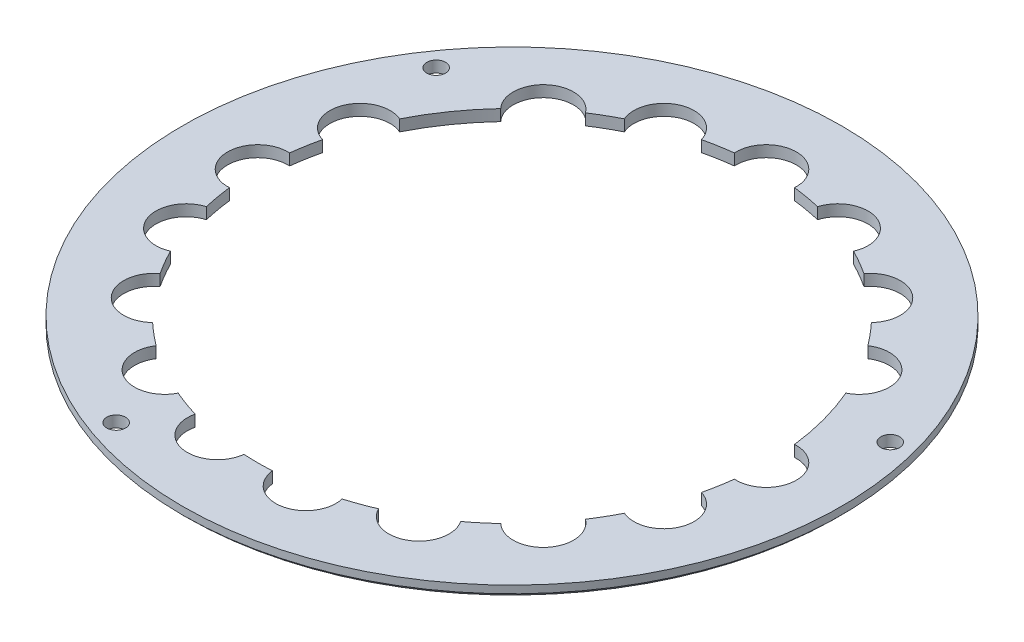
ISO-10303-21;
HEADER;
FILE_DESCRIPTION(('STEP AP214'),'2;1');
FILE_NAME('part.step','',(''),(''),'','','');
FILE_SCHEMA(('AUTOMOTIVE_DESIGN { 1 0 10303 214 1 1 1 1 }'));
ENDSEC;
DATA;
#1=APPLICATION_CONTEXT('core data for automotive mechanical design processes');
#2=APPLICATION_PROTOCOL_DEFINITION('international standard','automotive_design',2000,#1);
#3=PRODUCT_CONTEXT('',#1,'mechanical');
#4=PRODUCT('Part','Part','',(#3));
#5=PRODUCT_RELATED_PRODUCT_CATEGORY('part','',(#4));
#6=PRODUCT_DEFINITION_FORMATION('','',#4);
#7=PRODUCT_DEFINITION_CONTEXT('part definition',#1,'design');
#8=PRODUCT_DEFINITION('design','',#6,#7);
#9=PRODUCT_DEFINITION_SHAPE('','',#8);
#10=(LENGTH_UNIT() NAMED_UNIT(*) SI_UNIT(.MILLI.,.METRE.));
#11=(NAMED_UNIT(*) PLANE_ANGLE_UNIT() SI_UNIT($,.RADIAN.));
#12=(NAMED_UNIT(*) SI_UNIT($,.STERADIAN.) SOLID_ANGLE_UNIT());
#13=UNCERTAINTY_MEASURE_WITH_UNIT(LENGTH_MEASURE(1.E-05),#10,'distance_accuracy_value','');
#14=(GEOMETRIC_REPRESENTATION_CONTEXT(3) GLOBAL_UNCERTAINTY_ASSIGNED_CONTEXT((#13)) GLOBAL_UNIT_ASSIGNED_CONTEXT((#10,
#11,#12)) REPRESENTATION_CONTEXT('',''));
#15=CARTESIAN_POINT('',(0.,0.,0.));
#16=DIRECTION('',(0.,0.,1.));
#17=DIRECTION('',(1.,0.,0.));
#18=AXIS2_PLACEMENT_3D('',#15,#16,#17);
#19=CARTESIAN_POINT('',(0.,-0.00100000000000002,0.));
#20=DIRECTION('',(0.,1.,0.));
#21=DIRECTION('',(0.,0.,1.));
#22=AXIS2_PLACEMENT_3D('',#19,#20,#21);
#23=CYLINDRICAL_SURFACE('',#22,13.5);
#24=CARTESIAN_POINT('',(0.,0.,0.));
#25=DIRECTION('',(0.,1.,0.));
#26=DIRECTION('',(0.,0.,1.));
#27=AXIS2_PLACEMENT_3D('',#24,#25,#26);
#28=CIRCLE('',#27,13.5);
#29=CARTESIAN_POINT('',(-13.4051851851852,0.,-1.59718820146269));
#30=VERTEX_POINT('',#29);
#31=CARTESIAN_POINT('',(-13.1430241363694,0.,-3.08397739142346));
#32=VERTEX_POINT('',#31);
#33=EDGE_CURVE('E282',#30,#32,#28,.F.);
#34=ORIENTED_EDGE('',*,*,#33,.T.);
#35=DIRECTION('',(0.,1.,0.));
#36=VECTOR('',#35,1.);
#37=CARTESIAN_POINT('',(-13.1430241363694,0.3,-3.08397739142346));
#38=LINE('',#37,#36);
#39=CARTESIAN_POINT('',(-13.1430241363694,0.6,-3.08397739142346));
#40=VERTEX_POINT('',#39);
#41=EDGE_CURVE('E62',#40,#32,#38,.F.);
#42=ORIENTED_EDGE('',*,*,#41,.F.);
#43=CARTESIAN_POINT('',(0.,0.6,0.));
#44=DIRECTION('',(0.,1.,0.));
#45=DIRECTION('',(0.,0.,1.));
#46=AXIS2_PLACEMENT_3D('',#43,#44,#45);
#47=CIRCLE('',#46,13.5);
#48=CARTESIAN_POINT('',(-13.4051851851852,0.6,-1.5971882014627));
#49=VERTEX_POINT('',#48);
#50=EDGE_CURVE('E279',#40,#49,#47,.T.);
#51=ORIENTED_EDGE('',*,*,#50,.T.);
#52=DIRECTION('',(0.,1.,0.));
#53=VECTOR('',#52,1.);
#54=CARTESIAN_POINT('',(-13.4051851851852,0.3,-1.5971882014627));
#55=LINE('',#54,#53);
#56=EDGE_CURVE('E567',#30,#49,#55,.T.);
#57=ORIENTED_EDGE('',*,*,#56,.F.);
#58=EDGE_LOOP('',(#34,#42,#51,#57));
#59=FACE_BOUND('',#58,.T.);
#60=ADVANCED_FACE('F47',(#59),#23,.F.);
#61=CARTESIAN_POINT('',(-13.1430241363695,0.,3.08397739142328));
#62=VERTEX_POINT('',#61);
#63=CARTESIAN_POINT('',(-13.4051851851852,0.,1.59718820146269));
#64=VERTEX_POINT('',#63);
#65=EDGE_CURVE('E554',#62,#64,#28,.F.);
#66=ORIENTED_EDGE('',*,*,#65,.T.);
#67=DIRECTION('',(0.,1.,0.));
#68=VECTOR('',#67,1.);
#69=CARTESIAN_POINT('',(-13.4051851851852,0.3,1.5971882014627));
#70=LINE('',#69,#68);
#71=CARTESIAN_POINT('',(-13.4051851851852,0.6,1.5971882014627));
#72=VERTEX_POINT('',#71);
#73=EDGE_CURVE('E70',#72,#64,#70,.F.);
#74=ORIENTED_EDGE('',*,*,#73,.F.);
#75=CARTESIAN_POINT('',(-13.1430241363695,0.6,3.08397739142328));
#76=VERTEX_POINT('',#75);
#77=EDGE_CURVE('E291',#72,#76,#47,.T.);
#78=ORIENTED_EDGE('',*,*,#77,.T.);
#79=DIRECTION('',(0.,1.,0.));
#80=VECTOR('',#79,1.);
#81=CARTESIAN_POINT('',(-13.1430241363695,0.3,3.08397739142328));
#82=LINE('',#81,#80);
#83=EDGE_CURVE('E561',#62,#76,#82,.T.);
#84=ORIENTED_EDGE('',*,*,#83,.F.);
#85=EDGE_LOOP('',(#66,#74,#78,#84));
#86=FACE_BOUND('',#85,.T.);
#87=ADVANCED_FACE('F559',(#86),#23,.F.);
#88=CARTESIAN_POINT('',(-11.2956204063297,0.,7.39316979624485));
#89=VERTEX_POINT('',#88);
#90=CARTESIAN_POINT('',(-12.0504830612048,0.,6.0857093252649));
#91=VERTEX_POINT('',#90);
#92=EDGE_CURVE('E552',#89,#91,#28,.F.);
#93=ORIENTED_EDGE('',*,*,#92,.T.);
#94=DIRECTION('',(0.,1.,0.));
#95=VECTOR('',#94,1.);
#96=CARTESIAN_POINT('',(-12.0504830612048,0.3,6.08570932526491));
#97=LINE('',#96,#95);
#98=CARTESIAN_POINT('',(-12.0504830612048,0.6,6.08570932526491));
#99=VERTEX_POINT('',#98);
#100=EDGE_CURVE('E447',#99,#91,#97,.F.);
#101=ORIENTED_EDGE('',*,*,#100,.F.);
#102=CARTESIAN_POINT('',(-11.2956204063297,0.6,7.39316979624484));
#103=VERTEX_POINT('',#102);
#104=EDGE_CURVE('E296',#99,#103,#47,.T.);
#105=ORIENTED_EDGE('',*,*,#104,.T.);
#106=DIRECTION('',(0.,1.,0.));
#107=VECTOR('',#106,1.);
#108=CARTESIAN_POINT('',(-11.2956204063297,0.3,7.39316979624484));
#109=LINE('',#108,#107);
#110=EDGE_CURVE('E445',#89,#103,#109,.T.);
#111=ORIENTED_EDGE('',*,*,#110,.F.);
#112=EDGE_LOOP('',(#93,#101,#105,#111));
#113=FACE_BOUND('',#112,.T.);
#114=ADVANCED_FACE('F444',(#113),#23,.F.);
#115=CARTESIAN_POINT('',(-8.08579814968411,0.,10.8106368120738));
#116=VERTEX_POINT('',#115);
#117=CARTESIAN_POINT('',(-9.24231483385427,0.,9.84020408893623));
#118=VERTEX_POINT('',#117);
#119=EDGE_CURVE('E549',#116,#118,#28,.F.);
#120=ORIENTED_EDGE('',*,*,#119,.T.);
#121=DIRECTION('',(0.,1.,0.));
#122=VECTOR('',#121,1.);
#123=CARTESIAN_POINT('',(-9.24231483385426,0.3,9.84020408893624));
#124=LINE('',#123,#122);
#125=CARTESIAN_POINT('',(-9.24231483385426,0.6,9.84020408893624));
#126=VERTEX_POINT('',#125);
#127=EDGE_CURVE('E455',#126,#118,#124,.F.);
#128=ORIENTED_EDGE('',*,*,#127,.F.);
#129=CARTESIAN_POINT('',(-8.08579814968412,0.6,10.8106368120738));
#130=VERTEX_POINT('',#129);
#131=EDGE_CURVE('E427',#126,#130,#47,.T.);
#132=ORIENTED_EDGE('',*,*,#131,.T.);
#133=DIRECTION('',(0.,1.,0.));
#134=VECTOR('',#133,1.);
#135=CARTESIAN_POINT('',(-8.08579814968411,0.3,10.8106368120738));
#136=LINE('',#135,#134);
#137=EDGE_CURVE('E464',#116,#130,#136,.T.);
#138=ORIENTED_EDGE('',*,*,#137,.F.);
#139=EDGE_LOOP('',(#120,#128,#132,#138));
#140=FACE_BOUND('',#139,.T.);
#141=ADVANCED_FACE('F578',(#140),#23,.F.);
#142=CARTESIAN_POINT('',(-3.90070930251527,0.,12.9241814803596));
#143=VERTEX_POINT('',#142);
#144=CARTESIAN_POINT('',(-5.31938703550118,0.,12.4078250135365));
#145=VERTEX_POINT('',#144);
#146=EDGE_CURVE('E546',#143,#145,#28,.F.);
#147=ORIENTED_EDGE('',*,*,#146,.T.);
#148=DIRECTION('',(0.,1.,0.));
#149=VECTOR('',#148,1.);
#150=CARTESIAN_POINT('',(-5.31938703550118,0.3,12.4078250135365));
#151=LINE('',#150,#149);
#152=CARTESIAN_POINT('',(-5.31938703550118,0.6,12.4078250135365));
#153=VERTEX_POINT('',#152);
#154=EDGE_CURVE('E459',#153,#145,#151,.F.);
#155=ORIENTED_EDGE('',*,*,#154,.F.);
#156=CARTESIAN_POINT('',(-3.90070930251527,0.6,12.9241814803596));
#157=VERTEX_POINT('',#156);
#158=EDGE_CURVE('E421',#153,#157,#47,.T.);
#159=ORIENTED_EDGE('',*,*,#158,.T.);
#160=DIRECTION('',(0.,1.,0.));
#161=VECTOR('',#160,1.);
#162=CARTESIAN_POINT('',(-3.90070930251527,0.3,12.9241814803596));
#163=LINE('',#162,#161);
#164=EDGE_CURVE('E472',#143,#157,#163,.T.);
#165=ORIENTED_EDGE('',*,*,#164,.F.);
#166=EDGE_LOOP('',(#147,#155,#159,#165));
#167=FACE_BOUND('',#166,.T.);
#168=ADVANCED_FACE('F580',(#167),#23,.F.);
#169=CARTESIAN_POINT('',(0.754862654875016,0.,13.4788791215099));
#170=VERTEX_POINT('',#169);
#171=CARTESIAN_POINT('',(-0.754862654875107,0.,13.4788791215099));
#172=VERTEX_POINT('',#171);
#173=EDGE_CURVE('E543',#170,#172,#28,.F.);
#174=ORIENTED_EDGE('',*,*,#173,.T.);
#175=DIRECTION('',(0.,1.,0.));
#176=VECTOR('',#175,1.);
#177=CARTESIAN_POINT('',(-0.754862654875103,0.3,13.4788791215099));
#178=LINE('',#177,#176);
#179=CARTESIAN_POINT('',(-0.754862654875103,0.6,13.4788791215099));
#180=VERTEX_POINT('',#179);
#181=EDGE_CURVE('E470',#180,#172,#178,.F.);
#182=ORIENTED_EDGE('',*,*,#181,.F.);
#183=CARTESIAN_POINT('',(0.754862654875012,0.6,13.4788791215099));
#184=VERTEX_POINT('',#183);
#185=EDGE_CURVE('E415',#180,#184,#47,.T.);
#186=ORIENTED_EDGE('',*,*,#185,.T.);
#187=DIRECTION('',(0.,1.,0.));
#188=VECTOR('',#187,1.);
#189=CARTESIAN_POINT('',(0.754862654875012,0.3,13.4788791215099));
#190=LINE('',#189,#188);
#191=EDGE_CURVE('E480',#170,#184,#190,.T.);
#192=ORIENTED_EDGE('',*,*,#191,.F.);
#193=EDGE_LOOP('',(#174,#182,#186,#192));
#194=FACE_BOUND('',#193,.T.);
#195=ADVANCED_FACE('F586',(#194),#23,.F.);
#196=CARTESIAN_POINT('',(5.3193870355011,0.,12.4078250135365));
#197=VERTEX_POINT('',#196);
#198=CARTESIAN_POINT('',(3.90070930251518,0.,12.9241814803597));
#199=VERTEX_POINT('',#198);
#200=EDGE_CURVE('E540',#197,#199,#28,.F.);
#201=ORIENTED_EDGE('',*,*,#200,.T.);
#202=DIRECTION('',(0.,1.,0.));
#203=VECTOR('',#202,1.);
#204=CARTESIAN_POINT('',(3.90070930251519,0.3,12.9241814803597));
#205=LINE('',#204,#203);
#206=CARTESIAN_POINT('',(3.90070930251519,0.6,12.9241814803597));
#207=VERTEX_POINT('',#206);
#208=EDGE_CURVE('E478',#207,#199,#205,.F.);
#209=ORIENTED_EDGE('',*,*,#208,.F.);
#210=CARTESIAN_POINT('',(5.31938703550109,0.6,12.4078250135365));
#211=VERTEX_POINT('',#210);
#212=EDGE_CURVE('E409',#207,#211,#47,.T.);
#213=ORIENTED_EDGE('',*,*,#212,.T.);
#214=DIRECTION('',(0.,1.,0.));
#215=VECTOR('',#214,1.);
#216=CARTESIAN_POINT('',(5.31938703550109,0.3,12.4078250135365));
#217=LINE('',#216,#215);
#218=EDGE_CURVE('E488',#197,#211,#217,.T.);
#219=ORIENTED_EDGE('',*,*,#218,.F.);
#220=EDGE_LOOP('',(#201,#209,#213,#219));
#221=FACE_BOUND('',#220,.T.);
#222=ADVANCED_FACE('F716',(#221),#23,.F.);
#223=CARTESIAN_POINT('',(9.2423148338542,0.,9.8402040889363));
#224=VERTEX_POINT('',#223);
#225=CARTESIAN_POINT('',(8.08579814968404,0.,10.8106368120738));
#226=VERTEX_POINT('',#225);
#227=EDGE_CURVE('E537',#224,#226,#28,.F.);
#228=ORIENTED_EDGE('',*,*,#227,.T.);
#229=DIRECTION('',(0.,1.,0.));
#230=VECTOR('',#229,1.);
#231=CARTESIAN_POINT('',(8.08579814968404,0.3,10.8106368120738));
#232=LINE('',#231,#230);
#233=CARTESIAN_POINT('',(8.08579814968404,0.6,10.8106368120738));
#234=VERTEX_POINT('',#233);
#235=EDGE_CURVE('E486',#234,#226,#232,.F.);
#236=ORIENTED_EDGE('',*,*,#235,.F.);
#237=CARTESIAN_POINT('',(9.2423148338542,0.6,9.8402040889363));
#238=VERTEX_POINT('',#237);
#239=EDGE_CURVE('E403',#234,#238,#47,.T.);
#240=ORIENTED_EDGE('',*,*,#239,.T.);
#241=DIRECTION('',(0.,1.,0.));
#242=VECTOR('',#241,1.);
#243=CARTESIAN_POINT('',(9.2423148338542,0.3,9.8402040889363));
#244=LINE('',#243,#242);
#245=EDGE_CURVE('E496',#224,#238,#244,.T.);
#246=ORIENTED_EDGE('',*,*,#245,.F.);
#247=EDGE_LOOP('',(#228,#236,#240,#246));
#248=FACE_BOUND('',#247,.T.);
#249=ADVANCED_FACE('F712',(#248),#23,.F.);
#250=CARTESIAN_POINT('',(12.0504830612048,0.,6.08570932526499));
#251=VERTEX_POINT('',#250);
#252=CARTESIAN_POINT('',(11.2956204063297,0.,7.39316979624492));
#253=VERTEX_POINT('',#252);
#254=EDGE_CURVE('E532',#251,#253,#28,.F.);
#255=ORIENTED_EDGE('',*,*,#254,.T.);
#256=DIRECTION('',(0.,1.,0.));
#257=VECTOR('',#256,1.);
#258=CARTESIAN_POINT('',(11.2956204063297,0.3,7.39316979624492));
#259=LINE('',#258,#257);
#260=CARTESIAN_POINT('',(11.2956204063297,0.6,7.39316979624492));
#261=VERTEX_POINT('',#260);
#262=EDGE_CURVE('E494',#261,#253,#259,.F.);
#263=ORIENTED_EDGE('',*,*,#262,.F.);
#264=CARTESIAN_POINT('',(12.0504830612048,0.6,6.08570932526499));
#265=VERTEX_POINT('',#264);
#266=EDGE_CURVE('E397',#261,#265,#47,.T.);
#267=ORIENTED_EDGE('',*,*,#266,.T.);
#268=DIRECTION('',(0.,1.,0.));
#269=VECTOR('',#268,1.);
#270=CARTESIAN_POINT('',(12.0504830612048,0.3,6.08570932526499));
#271=LINE('',#270,#269);
#272=EDGE_CURVE('E504',#251,#265,#271,.T.);
#273=ORIENTED_EDGE('',*,*,#272,.F.);
#274=EDGE_LOOP('',(#255,#263,#267,#273));
#275=FACE_BOUND('',#274,.T.);
#276=ADVANCED_FACE('F708',(#275),#23,.F.);
#277=CARTESIAN_POINT('',(13.4051851851852,0.,1.59718820146269));
#278=VERTEX_POINT('',#277);
#279=CARTESIAN_POINT('',(13.1430241363694,0.,3.08397739142337));
#280=VERTEX_POINT('',#279);
#281=EDGE_CURVE('E528',#278,#280,#28,.F.);
#282=ORIENTED_EDGE('',*,*,#281,.T.);
#283=DIRECTION('',(0.,1.,0.));
#284=VECTOR('',#283,1.);
#285=CARTESIAN_POINT('',(13.1430241363694,0.3,3.08397739142337));
#286=LINE('',#285,#284);
#287=CARTESIAN_POINT('',(13.1430241363694,0.6,3.08397739142337));
#288=VERTEX_POINT('',#287);
#289=EDGE_CURVE('E502',#288,#280,#286,.F.);
#290=ORIENTED_EDGE('',*,*,#289,.F.);
#291=CARTESIAN_POINT('',(13.4051851851852,0.6,1.5971882014627));
#292=VERTEX_POINT('',#291);
#293=EDGE_CURVE('E393',#288,#292,#47,.T.);
#294=ORIENTED_EDGE('',*,*,#293,.T.);
#295=DIRECTION('',(0.,1.,0.));
#296=VECTOR('',#295,1.);
#297=CARTESIAN_POINT('',(13.4051851851852,0.3,1.5971882014627));
#298=LINE('',#297,#296);
#299=EDGE_CURVE('E512',#278,#292,#298,.T.);
#300=ORIENTED_EDGE('',*,*,#299,.F.);
#301=EDGE_LOOP('',(#282,#290,#294,#300));
#302=FACE_BOUND('',#301,.T.);
#303=ADVANCED_FACE('F627',(#302),#23,.F.);
#304=CARTESIAN_POINT('',(12.4078250135365,0.,-5.31938703550114));
#305=VERTEX_POINT('',#304);
#306=CARTESIAN_POINT('',(13.4051851851852,0.,-1.59718820146269));
#307=VERTEX_POINT('',#306);
#308=EDGE_CURVE('E307',#305,#307,#28,.F.);
#309=ORIENTED_EDGE('',*,*,#308,.T.);
#310=DIRECTION('',(0.,1.,0.));
#311=VECTOR('',#310,1.);
#312=CARTESIAN_POINT('',(13.4051851851852,0.3,-1.5971882014627));
#313=LINE('',#312,#311);
#314=CARTESIAN_POINT('',(13.4051851851852,0.6,-1.5971882014627));
#315=VERTEX_POINT('',#314);
#316=EDGE_CURVE('E510',#315,#307,#313,.F.);
#317=ORIENTED_EDGE('',*,*,#316,.F.);
#318=CARTESIAN_POINT('',(12.4078250135365,0.6,-5.31938703550114));
#319=VERTEX_POINT('',#318);
#320=EDGE_CURVE('E295',#315,#319,#47,.T.);
#321=ORIENTED_EDGE('',*,*,#320,.T.);
#322=DIRECTION('',(0.,1.,0.));
#323=VECTOR('',#322,1.);
#324=CARTESIAN_POINT('',(12.4078250135365,0.3,-5.31938703550114));
#325=LINE('',#324,#323);
#326=EDGE_CURVE('E385',#305,#319,#325,.T.);
#327=ORIENTED_EDGE('',*,*,#326,.F.);
#328=EDGE_LOOP('',(#309,#317,#321,#327));
#329=FACE_BOUND('',#328,.T.);
#330=ADVANCED_FACE('F623',(#329),#23,.F.);
#331=CARTESIAN_POINT('',(-9.84020408893633,0.6,-9.24231483385416));
#332=VERTEX_POINT('',#331);
#333=CARTESIAN_POINT('',(-12.0504830612047,0.6,-6.08570932526507));
#334=VERTEX_POINT('',#333);
#335=EDGE_CURVE('E290',#332,#334,#47,.T.);
#336=ORIENTED_EDGE('',*,*,#335,.T.);
#337=DIRECTION('',(0.,1.,0.));
#338=VECTOR('',#337,1.);
#339=CARTESIAN_POINT('',(-12.0504830612047,0.3,-6.08570932526507));
#340=LINE('',#339,#338);
#341=CARTESIAN_POINT('',(-12.0504830612047,0.,-6.08570932526507));
#342=VERTEX_POINT('',#341);
#343=EDGE_CURVE('E269',#342,#334,#340,.T.);
#344=ORIENTED_EDGE('',*,*,#343,.F.);
#345=CARTESIAN_POINT('',(-9.84020408893633,0.,-9.24231483385416));
#346=VERTEX_POINT('',#345);
#347=EDGE_CURVE('E523',#342,#346,#28,.F.);
#348=ORIENTED_EDGE('',*,*,#347,.T.);
#349=DIRECTION('',(0.,1.,0.));
#350=VECTOR('',#349,1.);
#351=CARTESIAN_POINT('',(-9.84020408893633,0.3,-9.24231483385416));
#352=LINE('',#351,#350);
#353=EDGE_CURVE('E345',#332,#346,#352,.F.);
#354=ORIENTED_EDGE('',*,*,#353,.F.);
#355=EDGE_LOOP('',(#336,#344,#348,#354));
#356=FACE_BOUND('',#355,.T.);
#357=ADVANCED_FACE('F619',(#356),#23,.F.);
#358=CARTESIAN_POINT('',(-6.08570932526503,0.6,-12.0504830612047));
#359=VERTEX_POINT('',#358);
#360=CARTESIAN_POINT('',(-7.39316979624496,0.6,-11.2956204063297));
#361=VERTEX_POINT('',#360);
#362=EDGE_CURVE('E294',#359,#361,#47,.T.);
#363=ORIENTED_EDGE('',*,*,#362,.T.);
#364=DIRECTION('',(0.,1.,0.));
#365=VECTOR('',#364,1.);
#366=CARTESIAN_POINT('',(-7.39316979624496,0.3,-11.2956204063297));
#367=LINE('',#366,#365);
#368=CARTESIAN_POINT('',(-7.39316979624496,0.,-11.2956204063297));
#369=VERTEX_POINT('',#368);
#370=EDGE_CURVE('E331',#369,#361,#367,.T.);
#371=ORIENTED_EDGE('',*,*,#370,.F.);
#372=CARTESIAN_POINT('',(-6.08570932526503,0.,-12.0504830612047));
#373=VERTEX_POINT('',#372);
#374=EDGE_CURVE('E525',#369,#373,#28,.F.);
#375=ORIENTED_EDGE('',*,*,#374,.T.);
#376=DIRECTION('',(0.,1.,0.));
#377=VECTOR('',#376,1.);
#378=CARTESIAN_POINT('',(-6.08570932526503,0.3,-12.0504830612047));
#379=LINE('',#378,#377);
#380=EDGE_CURVE('E334',#359,#373,#379,.F.);
#381=ORIENTED_EDGE('',*,*,#380,.F.);
#382=EDGE_LOOP('',(#363,#371,#375,#381));
#383=FACE_BOUND('',#382,.T.);
#384=ADVANCED_FACE('F330',(#383),#23,.F.);
#385=CARTESIAN_POINT('',(-1.59718820146275,0.6,-13.4051851851852));
#386=VERTEX_POINT('',#385);
#387=CARTESIAN_POINT('',(-3.08397739142342,0.6,-13.1430241363694));
#388=VERTEX_POINT('',#387);
#389=EDGE_CURVE('E315',#386,#388,#47,.T.);
#390=ORIENTED_EDGE('',*,*,#389,.T.);
#391=DIRECTION('',(0.,1.,0.));
#392=VECTOR('',#391,1.);
#393=CARTESIAN_POINT('',(-3.08397739142342,0.3,-13.1430241363694));
#394=LINE('',#393,#392);
#395=CARTESIAN_POINT('',(-3.08397739142342,0.,-13.1430241363694));
#396=VERTEX_POINT('',#395);
#397=EDGE_CURVE('E350',#396,#388,#394,.T.);
#398=ORIENTED_EDGE('',*,*,#397,.F.);
#399=CARTESIAN_POINT('',(-1.59718820146274,0.,-13.4051851851852));
#400=VERTEX_POINT('',#399);
#401=EDGE_CURVE('E527',#396,#400,#28,.F.);
#402=ORIENTED_EDGE('',*,*,#401,.T.);
#403=DIRECTION('',(0.,1.,0.));
#404=VECTOR('',#403,1.);
#405=CARTESIAN_POINT('',(-1.59718820146275,0.3,-13.4051851851852));
#406=LINE('',#405,#404);
#407=EDGE_CURVE('E355',#386,#400,#406,.F.);
#408=ORIENTED_EDGE('',*,*,#407,.F.);
#409=EDGE_LOOP('',(#390,#398,#402,#408));
#410=FACE_BOUND('',#409,.T.);
#411=ADVANCED_FACE('F612',(#410),#23,.F.);
#412=CARTESIAN_POINT('',(3.08397739142332,0.6,-13.1430241363694));
#413=VERTEX_POINT('',#412);
#414=CARTESIAN_POINT('',(1.59718820146264,0.6,-13.4051851851852));
#415=VERTEX_POINT('',#414);
#416=EDGE_CURVE('E309',#413,#415,#47,.T.);
#417=ORIENTED_EDGE('',*,*,#416,.T.);
#418=DIRECTION('',(0.,1.,0.));
#419=VECTOR('',#418,1.);
#420=CARTESIAN_POINT('',(1.59718820146264,0.3,-13.4051851851852));
#421=LINE('',#420,#419);
#422=CARTESIAN_POINT('',(1.59718820146264,0.,-13.4051851851852));
#423=VERTEX_POINT('',#422);
#424=EDGE_CURVE('E358',#423,#415,#421,.T.);
#425=ORIENTED_EDGE('',*,*,#424,.F.);
#426=CARTESIAN_POINT('',(3.08397739142332,0.,-13.1430241363694));
#427=VERTEX_POINT('',#426);
#428=EDGE_CURVE('E529',#423,#427,#28,.F.);
#429=ORIENTED_EDGE('',*,*,#428,.T.);
#430=DIRECTION('',(0.,1.,0.));
#431=VECTOR('',#430,1.);
#432=CARTESIAN_POINT('',(3.08397739142332,0.3,-13.1430241363694));
#433=LINE('',#432,#431);
#434=EDGE_CURVE('E364',#413,#427,#433,.F.);
#435=ORIENTED_EDGE('',*,*,#434,.F.);
#436=EDGE_LOOP('',(#417,#425,#429,#435));
#437=FACE_BOUND('',#436,.T.);
#438=ADVANCED_FACE('F606',(#437),#23,.F.);
#439=CARTESIAN_POINT('',(7.39316979624488,0.6,-11.2956204063297));
#440=VERTEX_POINT('',#439);
#441=CARTESIAN_POINT('',(6.08570932526494,0.6,-12.0504830612048));
#442=VERTEX_POINT('',#441);
#443=EDGE_CURVE('E301',#440,#442,#47,.T.);
#444=ORIENTED_EDGE('',*,*,#443,.T.);
#445=DIRECTION('',(0.,1.,0.));
#446=VECTOR('',#445,1.);
#447=CARTESIAN_POINT('',(6.08570932526494,0.3,-12.0504830612048));
#448=LINE('',#447,#446);
#449=CARTESIAN_POINT('',(6.08570932526494,0.,-12.0504830612048));
#450=VERTEX_POINT('',#449);
#451=EDGE_CURVE('E367',#450,#442,#448,.T.);
#452=ORIENTED_EDGE('',*,*,#451,.F.);
#453=CARTESIAN_POINT('',(7.39316979624487,0.,-11.2956204063297));
#454=VERTEX_POINT('',#453);
#455=EDGE_CURVE('E306',#450,#454,#28,.F.);
#456=ORIENTED_EDGE('',*,*,#455,.T.);
#457=DIRECTION('',(0.,1.,0.));
#458=VECTOR('',#457,1.);
#459=CARTESIAN_POINT('',(7.39316979624488,0.3,-11.2956204063297));
#460=LINE('',#459,#458);
#461=EDGE_CURVE('E373',#440,#454,#460,.F.);
#462=ORIENTED_EDGE('',*,*,#461,.F.);
#463=EDGE_LOOP('',(#444,#452,#456,#462));
#464=FACE_BOUND('',#463,.T.);
#465=ADVANCED_FACE('F596',(#464),#23,.F.);
#466=CARTESIAN_POINT('',(0.,0.6,0.));
#467=DIRECTION('',(0.,-1.,0.));
#468=DIRECTION('',(0.,0.,-1.));
#469=AXIS2_PLACEMENT_3D('',#466,#467,#468);
#470=CYLINDRICAL_SURFACE('',#469,17.5);
#471=CARTESIAN_POINT('',(0.,0.200000000000006,0.));
#472=DIRECTION('',(0.,1.,0.));
#473=DIRECTION('',(0.,0.,1.));
#474=AXIS2_PLACEMENT_3D('',#471,#472,#473);
#475=CIRCLE('',#474,17.5);
#476=CARTESIAN_POINT('',(0.,0.200000000000006,17.5));
#477=VERTEX_POINT('',#476);
#478=EDGE_CURVE('E55',#477,#477,#475,.T.);
#479=ORIENTED_EDGE('',*,*,#478,.T.);
#480=EDGE_LOOP('',(#479));
#481=FACE_BOUND('',#480,.T.);
#482=CARTESIAN_POINT('',(0.,0.6,0.));
#483=DIRECTION('',(0.,1.,0.));
#484=DIRECTION('',(0.,0.,1.));
#485=AXIS2_PLACEMENT_3D('',#482,#483,#484);
#486=CIRCLE('',#485,17.5);
#487=CARTESIAN_POINT('',(0.,0.6,17.5));
#488=VERTEX_POINT('',#487);
#489=EDGE_CURVE('E535',#488,#488,#486,.T.);
#490=ORIENTED_EDGE('',*,*,#489,.F.);
#491=EDGE_LOOP('',(#490));
#492=FACE_BOUND('',#491,.T.);
#493=ADVANCED_FACE('F605',(#481,#492),#470,.T.);
#494=CARTESIAN_POINT('',(0.,0.6,0.));
#495=DIRECTION('',(0.,1.,0.));
#496=DIRECTION('',(0.,0.,1.));
#497=AXIS2_PLACEMENT_3D('',#494,#495,#496);
#498=PLANE('',#497);
#499=CARTESIAN_POINT('',(15.8411835511407,0.6,-4.24463233968135));
#500=DIRECTION('',(0.,1.,0.));
#501=DIRECTION('',(0.,0.,1.));
#502=AXIS2_PLACEMENT_3D('',#499,#500,#501);
#503=CIRCLE('',#502,0.5);
#504=CARTESIAN_POINT('',(15.8411835511407,0.6,-3.74463233968135));
#505=VERTEX_POINT('',#504);
#506=EDGE_CURVE('E966',#505,#505,#503,.T.);
#507=ORIENTED_EDGE('',*,*,#506,.F.);
#508=EDGE_LOOP('',(#507));
#509=FACE_BOUND('',#508,.T.);
#510=CARTESIAN_POINT('',(-13.4340935263395,0.6,-9.40665355615707));
#511=DIRECTION('',(0.,1.,0.));
#512=DIRECTION('',(0.,0.,1.));
#513=AXIS2_PLACEMENT_3D('',#510,#511,#512);
#514=CIRCLE('',#513,0.5);
#515=CARTESIAN_POINT('',(-13.4340935263395,0.6,-8.90665355615707));
#516=VERTEX_POINT('',#515);
#517=EDGE_CURVE('E962',#516,#516,#514,.T.);
#518=ORIENTED_EDGE('',*,*,#517,.F.);
#519=EDGE_LOOP('',(#518));
#520=FACE_BOUND('',#519,.T.);
#521=CARTESIAN_POINT('',(-5.60913035054103,0.6,15.4109589808889));
#522=DIRECTION('',(0.,1.,0.));
#523=DIRECTION('',(0.,0.,1.));
#524=AXIS2_PLACEMENT_3D('',#521,#522,#523);
#525=CIRCLE('',#524,0.5);
#526=CARTESIAN_POINT('',(-5.60913035054103,0.6,15.9109589808889));
#527=VERTEX_POINT('',#526);
#528=EDGE_CURVE('E957',#527,#527,#525,.T.);
#529=ORIENTED_EDGE('',*,*,#528,.F.);
#530=EDGE_LOOP('',(#529));
#531=FACE_BOUND('',#530,.T.);
#532=CARTESIAN_POINT('',(-12.6858503806097,0.6,-4.61727193489662));
#533=DIRECTION('',(0.,1.,0.));
#534=DIRECTION('',(0.342020143325676,0.,-0.939692620785906));
#535=AXIS2_PLACEMENT_3D('',#532,#533,#534);
#536=CIRCLE('',#535,1.6);
#537=EDGE_CURVE('E266',#334,#40,#536,.T.);
#538=ORIENTED_EDGE('',*,*,#537,.F.);
#539=ORIENTED_EDGE('',*,*,#335,.F.);
#540=CARTESIAN_POINT('',(-8.67763273076834,0.6,-10.3415999821062));
#541=DIRECTION('',(0.,1.,0.));
#542=DIRECTION('',(0.984807753012207,0.,-0.173648177666934));
#543=AXIS2_PLACEMENT_3D('',#540,#541,#542);
#544=CIRCLE('',#543,1.6);
#545=EDGE_CURVE('E338',#361,#332,#544,.T.);
#546=ORIENTED_EDGE('',*,*,#545,.F.);
#547=ORIENTED_EDGE('',*,*,#362,.F.);
#548=CARTESIAN_POINT('',(-4.61727193489658,0.6,-12.6858503806097));
#549=DIRECTION('',(0.,1.,0.));
#550=DIRECTION('',(0.984807753012209,0.,0.173648177666927));
#551=AXIS2_PLACEMENT_3D('',#548,#549,#550);
#552=CIRCLE('',#551,1.6);
#553=EDGE_CURVE('E337',#388,#359,#552,.T.);
#554=ORIENTED_EDGE('',*,*,#553,.F.);
#555=ORIENTED_EDGE('',*,*,#389,.F.);
#556=CARTESIAN_POINT('',(0.,0.6,-13.5));
#557=DIRECTION('',(0.,1.,0.));
#558=DIRECTION('',(0.86602540378444,0.,0.499999999999998));
#559=AXIS2_PLACEMENT_3D('',#556,#557,#558);
#560=CIRCLE('',#559,1.6);
#561=EDGE_CURVE('E360',#415,#386,#560,.T.);
#562=ORIENTED_EDGE('',*,*,#561,.F.);
#563=ORIENTED_EDGE('',*,*,#416,.F.);
#564=CARTESIAN_POINT('',(4.61727193489649,0.6,-12.6858503806098));
#565=DIRECTION('',(0.,1.,0.));
#566=DIRECTION('',(0.642787609686541,0.,0.766044443118977));
#567=AXIS2_PLACEMENT_3D('',#564,#565,#566);
#568=CIRCLE('',#567,1.6);
#569=EDGE_CURVE('E369',#442,#413,#568,.T.);
#570=ORIENTED_EDGE('',*,*,#569,.F.);
#571=ORIENTED_EDGE('',*,*,#443,.F.);
#572=CARTESIAN_POINT('',(8.67763273076826,0.6,-10.3415999821062));
#573=DIRECTION('',(0.,1.,0.));
#574=DIRECTION('',(0.342020143325669,0.,0.939692620785908));
#575=AXIS2_PLACEMENT_3D('',#572,#573,#574);
#576=CIRCLE('',#575,1.6);
#577=CARTESIAN_POINT('',(9.84020408893627,0.6,-9.24231483385423));
#578=VERTEX_POINT('',#577);
#579=EDGE_CURVE('E378',#578,#440,#576,.T.);
#580=ORIENTED_EDGE('',*,*,#579,.F.);
#581=CARTESIAN_POINT('',(10.8106368120738,0.6,-8.08579814968408));
#582=VERTEX_POINT('',#581);
#583=EDGE_CURVE('E293',#582,#578,#47,.T.);
#584=ORIENTED_EDGE('',*,*,#583,.F.);
#585=CARTESIAN_POINT('',(11.6913429510899,0.6,-6.75000000000002));
#586=DIRECTION('',(0.,1.,0.));
#587=DIRECTION('',(0.,0.,1.));
#588=AXIS2_PLACEMENT_3D('',#585,#586,#587);
#589=CIRCLE('',#588,1.6);
#590=EDGE_CURVE('E388',#319,#582,#589,.T.);
#591=ORIENTED_EDGE('',*,*,#590,.F.);
#592=ORIENTED_EDGE('',*,*,#320,.F.);
#593=CARTESIAN_POINT('',(13.5,0.6,0.));
#594=DIRECTION('',(0.,1.,0.));
#595=DIRECTION('',(0.,0.,1.));
#596=AXIS2_PLACEMENT_3D('',#593,#594,#595);
#597=CIRCLE('',#596,1.6);
#598=EDGE_CURVE('E514',#292,#315,#597,.T.);
#599=ORIENTED_EDGE('',*,*,#598,.F.);
#600=ORIENTED_EDGE('',*,*,#293,.F.);
#601=CARTESIAN_POINT('',(12.6858503806098,0.6,4.61727193489654));
#602=DIRECTION('',(0.,1.,0.));
#603=DIRECTION('',(-0.342020143325669,0.,0.939692620785908));
#604=AXIS2_PLACEMENT_3D('',#601,#602,#603);
#605=CIRCLE('',#604,1.6);
#606=EDGE_CURVE('E506',#265,#288,#605,.T.);
#607=ORIENTED_EDGE('',*,*,#606,.F.);
#608=ORIENTED_EDGE('',*,*,#266,.F.);
#609=CARTESIAN_POINT('',(10.3415999821062,0.6,8.6776327307683));
#610=DIRECTION('',(0.,1.,0.));
#611=DIRECTION('',(-0.642787609686541,0.,0.766044443118977));
#612=AXIS2_PLACEMENT_3D('',#609,#610,#611);
#613=CIRCLE('',#612,1.6);
#614=EDGE_CURVE('E498',#238,#261,#613,.T.);
#615=ORIENTED_EDGE('',*,*,#614,.F.);
#616=ORIENTED_EDGE('',*,*,#239,.F.);
#617=CARTESIAN_POINT('',(6.74999999999997,0.6,11.6913429510899));
#618=DIRECTION('',(0.,1.,0.));
#619=DIRECTION('',(-0.86602540378444,0.,0.499999999999998));
#620=AXIS2_PLACEMENT_3D('',#617,#618,#619);
#621=CIRCLE('',#620,1.6);
#622=EDGE_CURVE('E490',#211,#234,#621,.T.);
#623=ORIENTED_EDGE('',*,*,#622,.F.);
#624=ORIENTED_EDGE('',*,*,#212,.F.);
#625=CARTESIAN_POINT('',(2.34425039850352,0.6,13.2949046656648));
#626=DIRECTION('',(0.,1.,0.));
#627=DIRECTION('',(-0.984807753012209,0.,0.173648177666927));
#628=AXIS2_PLACEMENT_3D('',#625,#626,#627);
#629=CIRCLE('',#628,1.6);
#630=EDGE_CURVE('E482',#184,#207,#629,.T.);
#631=ORIENTED_EDGE('',*,*,#630,.F.);
#632=ORIENTED_EDGE('',*,*,#185,.F.);
#633=CARTESIAN_POINT('',(-2.34425039850361,0.6,13.2949046656648));
#634=DIRECTION('',(0.,1.,0.));
#635=DIRECTION('',(-0.984807753012207,0.,-0.173648177666934));
#636=AXIS2_PLACEMENT_3D('',#633,#634,#635);
#637=CIRCLE('',#636,1.6);
#638=EDGE_CURVE('E474',#157,#180,#637,.T.);
#639=ORIENTED_EDGE('',*,*,#638,.F.);
#640=ORIENTED_EDGE('',*,*,#158,.F.);
#641=CARTESIAN_POINT('',(-6.75000000000006,0.6,11.6913429510899));
#642=DIRECTION('',(0.,1.,0.));
#643=DIRECTION('',(-0.866025403784436,0.,-0.500000000000004));
#644=AXIS2_PLACEMENT_3D('',#641,#642,#643);
#645=CIRCLE('',#644,1.6);
#646=EDGE_CURVE('E466',#130,#153,#645,.T.);
#647=ORIENTED_EDGE('',*,*,#646,.F.);
#648=ORIENTED_EDGE('',*,*,#131,.F.);
#649=CARTESIAN_POINT('',(-10.3415999821062,0.6,8.67763273076823));
#650=DIRECTION('',(0.,1.,0.));
#651=DIRECTION('',(-0.642787609686535,0.,-0.766044443118981));
#652=AXIS2_PLACEMENT_3D('',#649,#650,#651);
#653=CIRCLE('',#652,1.6);
#654=EDGE_CURVE('E452',#103,#126,#653,.T.);
#655=ORIENTED_EDGE('',*,*,#654,.F.);
#656=ORIENTED_EDGE('',*,*,#104,.F.);
#657=CARTESIAN_POINT('',(-12.6858503806098,0.6,4.61727193489645));
#658=DIRECTION('',(0.,1.,0.));
#659=DIRECTION('',(-0.342020143325663,0.,-0.939692620785911));
#660=AXIS2_PLACEMENT_3D('',#657,#658,#659);
#661=CIRCLE('',#660,1.6);
#662=EDGE_CURVE('E572',#76,#99,#661,.T.);
#663=ORIENTED_EDGE('',*,*,#662,.F.);
#664=ORIENTED_EDGE('',*,*,#77,.F.);
#665=CARTESIAN_POINT('',(-13.5,0.6,0.));
#666=DIRECTION('',(0.,1.,0.));
#667=DIRECTION('',(0.,0.,-1.));
#668=AXIS2_PLACEMENT_3D('',#665,#666,#667);
#669=CIRCLE('',#668,1.6);
#670=EDGE_CURVE('E289',#49,#72,#669,.T.);
#671=ORIENTED_EDGE('',*,*,#670,.F.);
#672=ORIENTED_EDGE('',*,*,#50,.F.);
#673=EDGE_LOOP('',(#538,#539,#546,#547,#554,#555,#562,#563,#570,#571,#580,#584,#591,#592,#599,
#600,#607,#608,#615,#616,#623,#624,#631,#632,#639,#640,#647,#648,#655,#656,#663,#664,#671,#672));
#674=FACE_BOUND('',#673,.T.);
#675=ORIENTED_EDGE('',*,*,#489,.T.);
#676=EDGE_LOOP('',(#675));
#677=FACE_BOUND('',#676,.T.);
#678=ADVANCED_FACE('F286',(#509,#520,#531,#674,#677),#498,.T.);
#679=CARTESIAN_POINT('',(0.,0.,0.));
#680=DIRECTION('',(0.,1.,0.));
#681=DIRECTION('',(0.,0.,1.));
#682=AXIS2_PLACEMENT_3D('',#679,#680,#681);
#683=PLANE('',#682);
#684=CARTESIAN_POINT('',(0.,0.,0.));
#685=DIRECTION('',(0.,1.,0.));
#686=DIRECTION('',(0.,0.,1.));
#687=AXIS2_PLACEMENT_3D('',#684,#685,#686);
#688=CIRCLE('',#687,17.3);
#689=CARTESIAN_POINT('',(0.,0.,17.3));
#690=VERTEX_POINT('',#689);
#691=EDGE_CURVE('E13',#690,#690,#688,.F.);
#692=ORIENTED_EDGE('',*,*,#691,.T.);
#693=EDGE_LOOP('',(#692));
#694=FACE_BOUND('',#693,.T.);
#695=CARTESIAN_POINT('',(15.8411835511407,0.,-4.24463233968135));
#696=DIRECTION('',(0.,1.,0.));
#697=DIRECTION('',(0.,0.,1.));
#698=AXIS2_PLACEMENT_3D('',#695,#696,#697);
#699=CIRCLE('',#698,0.5);
#700=CARTESIAN_POINT('',(15.8411835511407,0.,-3.74463233968135));
#701=VERTEX_POINT('',#700);
#702=EDGE_CURVE('E950',#701,#701,#699,.T.);
#703=ORIENTED_EDGE('',*,*,#702,.T.);
#704=EDGE_LOOP('',(#703));
#705=FACE_BOUND('',#704,.T.);
#706=CARTESIAN_POINT('',(-13.4340935263395,0.,-9.40665355615707));
#707=DIRECTION('',(0.,1.,0.));
#708=DIRECTION('',(0.,0.,1.));
#709=AXIS2_PLACEMENT_3D('',#706,#707,#708);
#710=CIRCLE('',#709,0.5);
#711=CARTESIAN_POINT('',(-13.4340935263395,0.,-8.90665355615707));
#712=VERTEX_POINT('',#711);
#713=EDGE_CURVE('E954',#712,#712,#710,.T.);
#714=ORIENTED_EDGE('',*,*,#713,.T.);
#715=EDGE_LOOP('',(#714));
#716=FACE_BOUND('',#715,.T.);
#717=CARTESIAN_POINT('',(-5.60913035054103,0.,15.4109589808889));
#718=DIRECTION('',(0.,1.,0.));
#719=DIRECTION('',(0.,0.,1.));
#720=AXIS2_PLACEMENT_3D('',#717,#718,#719);
#721=CIRCLE('',#720,0.5);
#722=CARTESIAN_POINT('',(-5.60913035054103,0.,15.9109589808889));
#723=VERTEX_POINT('',#722);
#724=EDGE_CURVE('E283',#723,#723,#721,.T.);
#725=ORIENTED_EDGE('',*,*,#724,.T.);
#726=EDGE_LOOP('',(#725));
#727=FACE_BOUND('',#726,.T.);
#728=ORIENTED_EDGE('',*,*,#347,.F.);
#729=CARTESIAN_POINT('',(-12.6858503806097,0.,-4.61727193489662));
#730=DIRECTION('',(0.,1.,0.));
#731=DIRECTION('',(0.,0.,1.));
#732=AXIS2_PLACEMENT_3D('',#729,#730,#731);
#733=CIRCLE('',#732,1.6);
#734=EDGE_CURVE('E274',#32,#342,#733,.F.);
#735=ORIENTED_EDGE('',*,*,#734,.F.);
#736=ORIENTED_EDGE('',*,*,#33,.F.);
#737=CARTESIAN_POINT('',(-13.5,0.,0.));
#738=DIRECTION('',(0.,1.,0.));
#739=DIRECTION('',(0.,0.,1.));
#740=AXIS2_PLACEMENT_3D('',#737,#738,#739);
#741=CIRCLE('',#740,1.6);
#742=EDGE_CURVE('E564',#64,#30,#741,.F.);
#743=ORIENTED_EDGE('',*,*,#742,.F.);
#744=ORIENTED_EDGE('',*,*,#65,.F.);
#745=CARTESIAN_POINT('',(-12.6858503806098,0.,4.61727193489645));
#746=DIRECTION('',(0.,1.,0.));
#747=DIRECTION('',(0.,0.,1.));
#748=AXIS2_PLACEMENT_3D('',#745,#746,#747);
#749=CIRCLE('',#748,1.6);
#750=EDGE_CURVE('E563',#91,#62,#749,.F.);
#751=ORIENTED_EDGE('',*,*,#750,.F.);
#752=ORIENTED_EDGE('',*,*,#92,.F.);
#753=CARTESIAN_POINT('',(-10.3415999821062,0.,8.67763273076823));
#754=DIRECTION('',(0.,1.,0.));
#755=DIRECTION('',(0.,0.,1.));
#756=AXIS2_PLACEMENT_3D('',#753,#754,#755);
#757=CIRCLE('',#756,1.6);
#758=EDGE_CURVE('E454',#118,#89,#757,.F.);
#759=ORIENTED_EDGE('',*,*,#758,.F.);
#760=ORIENTED_EDGE('',*,*,#119,.F.);
#761=CARTESIAN_POINT('',(-6.75000000000006,0.,11.6913429510899));
#762=DIRECTION('',(0.,1.,0.));
#763=DIRECTION('',(0.,0.,1.));
#764=AXIS2_PLACEMENT_3D('',#761,#762,#763);
#765=CIRCLE('',#764,1.6);
#766=EDGE_CURVE('E468',#145,#116,#765,.F.);
#767=ORIENTED_EDGE('',*,*,#766,.F.);
#768=ORIENTED_EDGE('',*,*,#146,.F.);
#769=CARTESIAN_POINT('',(-2.34425039850361,0.,13.2949046656648));
#770=DIRECTION('',(0.,1.,0.));
#771=DIRECTION('',(0.,0.,1.));
#772=AXIS2_PLACEMENT_3D('',#769,#770,#771);
#773=CIRCLE('',#772,1.6);
#774=EDGE_CURVE('E476',#172,#143,#773,.F.);
#775=ORIENTED_EDGE('',*,*,#774,.F.);
#776=ORIENTED_EDGE('',*,*,#173,.F.);
#777=CARTESIAN_POINT('',(2.34425039850352,0.,13.2949046656648));
#778=DIRECTION('',(0.,1.,0.));
#779=DIRECTION('',(0.,0.,1.));
#780=AXIS2_PLACEMENT_3D('',#777,#778,#779);
#781=CIRCLE('',#780,1.6);
#782=EDGE_CURVE('E484',#199,#170,#781,.F.);
#783=ORIENTED_EDGE('',*,*,#782,.F.);
#784=ORIENTED_EDGE('',*,*,#200,.F.);
#785=CARTESIAN_POINT('',(6.74999999999997,0.,11.6913429510899));
#786=DIRECTION('',(0.,1.,0.));
#787=DIRECTION('',(0.,0.,1.));
#788=AXIS2_PLACEMENT_3D('',#785,#786,#787);
#789=CIRCLE('',#788,1.6);
#790=EDGE_CURVE('E492',#226,#197,#789,.F.);
#791=ORIENTED_EDGE('',*,*,#790,.F.);
#792=ORIENTED_EDGE('',*,*,#227,.F.);
#793=CARTESIAN_POINT('',(10.3415999821062,0.,8.6776327307683));
#794=DIRECTION('',(0.,1.,0.));
#795=DIRECTION('',(0.,0.,1.));
#796=AXIS2_PLACEMENT_3D('',#793,#794,#795);
#797=CIRCLE('',#796,1.6);
#798=EDGE_CURVE('E500',#253,#224,#797,.F.);
#799=ORIENTED_EDGE('',*,*,#798,.F.);
#800=ORIENTED_EDGE('',*,*,#254,.F.);
#801=CARTESIAN_POINT('',(12.6858503806098,0.,4.61727193489654));
#802=DIRECTION('',(0.,1.,0.));
#803=DIRECTION('',(0.,0.,1.));
#804=AXIS2_PLACEMENT_3D('',#801,#802,#803);
#805=CIRCLE('',#804,1.6);
#806=EDGE_CURVE('E508',#280,#251,#805,.F.);
#807=ORIENTED_EDGE('',*,*,#806,.F.);
#808=ORIENTED_EDGE('',*,*,#281,.F.);
#809=CARTESIAN_POINT('',(13.5,0.,0.));
#810=DIRECTION('',(0.,1.,0.));
#811=DIRECTION('',(0.,0.,1.));
#812=AXIS2_PLACEMENT_3D('',#809,#810,#811);
#813=CIRCLE('',#812,1.6);
#814=EDGE_CURVE('E516',#307,#278,#813,.F.);
#815=ORIENTED_EDGE('',*,*,#814,.F.);
#816=ORIENTED_EDGE('',*,*,#308,.F.);
#817=CARTESIAN_POINT('',(11.6913429510899,0.,-6.75000000000002));
#818=DIRECTION('',(0.,1.,0.));
#819=DIRECTION('',(0.,0.,1.));
#820=AXIS2_PLACEMENT_3D('',#817,#818,#819);
#821=CIRCLE('',#820,1.6);
#822=CARTESIAN_POINT('',(10.8106368120738,0.,-8.08579814968408));
#823=VERTEX_POINT('',#822);
#824=EDGE_CURVE('E389',#823,#305,#821,.F.);
#825=ORIENTED_EDGE('',*,*,#824,.F.);
#826=CARTESIAN_POINT('',(9.84020408893627,0.,-9.24231483385423));
#827=VERTEX_POINT('',#826);
#828=EDGE_CURVE('E300',#827,#823,#28,.F.);
#829=ORIENTED_EDGE('',*,*,#828,.F.);
#830=CARTESIAN_POINT('',(8.67763273076826,0.,-10.3415999821062));
#831=DIRECTION('',(0.,1.,0.));
#832=DIRECTION('',(0.,0.,1.));
#833=AXIS2_PLACEMENT_3D('',#830,#831,#832);
#834=CIRCLE('',#833,1.6);
#835=EDGE_CURVE('E380',#454,#827,#834,.F.);
#836=ORIENTED_EDGE('',*,*,#835,.F.);
#837=ORIENTED_EDGE('',*,*,#455,.F.);
#838=CARTESIAN_POINT('',(4.61727193489649,0.,-12.6858503806098));
#839=DIRECTION('',(0.,1.,0.));
#840=DIRECTION('',(0.,0.,1.));
#841=AXIS2_PLACEMENT_3D('',#838,#839,#840);
#842=CIRCLE('',#841,1.6);
#843=EDGE_CURVE('E371',#427,#450,#842,.F.);
#844=ORIENTED_EDGE('',*,*,#843,.F.);
#845=ORIENTED_EDGE('',*,*,#428,.F.);
#846=CARTESIAN_POINT('',(0.,0.,-13.5));
#847=DIRECTION('',(0.,1.,0.));
#848=DIRECTION('',(0.,0.,1.));
#849=AXIS2_PLACEMENT_3D('',#846,#847,#848);
#850=CIRCLE('',#849,1.6);
#851=EDGE_CURVE('E362',#400,#423,#850,.F.);
#852=ORIENTED_EDGE('',*,*,#851,.F.);
#853=ORIENTED_EDGE('',*,*,#401,.F.);
#854=CARTESIAN_POINT('',(-4.61727193489658,0.,-12.6858503806097));
#855=DIRECTION('',(0.,1.,0.));
#856=DIRECTION('',(0.,0.,1.));
#857=AXIS2_PLACEMENT_3D('',#854,#855,#856);
#858=CIRCLE('',#857,1.6);
#859=EDGE_CURVE('E353',#373,#396,#858,.F.);
#860=ORIENTED_EDGE('',*,*,#859,.F.);
#861=ORIENTED_EDGE('',*,*,#374,.F.);
#862=CARTESIAN_POINT('',(-8.67763273076834,0.,-10.3415999821062));
#863=DIRECTION('',(0.,1.,0.));
#864=DIRECTION('',(0.,0.,1.));
#865=AXIS2_PLACEMENT_3D('',#862,#863,#864);
#866=CIRCLE('',#865,1.6);
#867=EDGE_CURVE('E342',#346,#369,#866,.F.);
#868=ORIENTED_EDGE('',*,*,#867,.F.);
#869=EDGE_LOOP('',(#728,#735,#736,#743,#744,#751,#752,#759,#760,#767,#768,#775,#776,#783,#784,
#791,#792,#799,#800,#807,#808,#815,#816,#825,#829,#836,#837,#844,#845,#852,#853,#860,#861,#868));
#870=FACE_BOUND('',#869,.T.);
#871=ADVANCED_FACE('F522',(#694,#705,#716,#727,#870),#683,.F.);
#872=ORIENTED_EDGE('',*,*,#583,.T.);
#873=DIRECTION('',(0.,1.,0.));
#874=VECTOR('',#873,1.);
#875=CARTESIAN_POINT('',(9.84020408893627,0.3,-9.24231483385423));
#876=LINE('',#875,#874);
#877=EDGE_CURVE('E376',#827,#578,#876,.T.);
#878=ORIENTED_EDGE('',*,*,#877,.F.);
#879=ORIENTED_EDGE('',*,*,#828,.T.);
#880=DIRECTION('',(0.,1.,0.));
#881=VECTOR('',#880,1.);
#882=CARTESIAN_POINT('',(10.8106368120738,0.3,-8.08579814968408));
#883=LINE('',#882,#881);
#884=EDGE_CURVE('E382',#582,#823,#883,.F.);
#885=ORIENTED_EDGE('',*,*,#884,.F.);
#886=EDGE_LOOP('',(#872,#878,#879,#885));
#887=FACE_BOUND('',#886,.T.);
#888=ADVANCED_FACE('F587',(#887),#23,.F.);
#889=CARTESIAN_POINT('',(11.6913429510899,-0.00100000000000002,-6.75000000000002));
#890=DIRECTION('',(0.,1.,0.));
#891=DIRECTION('',(0.,0.,1.));
#892=AXIS2_PLACEMENT_3D('',#889,#890,#891);
#893=CYLINDRICAL_SURFACE('',#892,1.6);
#894=ORIENTED_EDGE('',*,*,#326,.T.);
#895=ORIENTED_EDGE('',*,*,#590,.T.);
#896=ORIENTED_EDGE('',*,*,#884,.T.);
#897=ORIENTED_EDGE('',*,*,#824,.T.);
#898=EDGE_LOOP('',(#894,#895,#896,#897));
#899=FACE_BOUND('',#898,.T.);
#900=ADVANCED_FACE('F595',(#899),#893,.F.);
#901=CARTESIAN_POINT('',(8.67763273076826,-0.00100000000000002,-10.3415999821062));
#902=DIRECTION('',(0.,1.,0.));
#903=DIRECTION('',(0.,0.,1.));
#904=AXIS2_PLACEMENT_3D('',#901,#902,#903);
#905=CYLINDRICAL_SURFACE('',#904,1.6);
#906=ORIENTED_EDGE('',*,*,#877,.T.);
#907=ORIENTED_EDGE('',*,*,#579,.T.);
#908=ORIENTED_EDGE('',*,*,#461,.T.);
#909=ORIENTED_EDGE('',*,*,#835,.T.);
#910=EDGE_LOOP('',(#906,#907,#908,#909));
#911=FACE_BOUND('',#910,.T.);
#912=ADVANCED_FACE('F601',(#911),#905,.F.);
#913=CARTESIAN_POINT('',(4.61727193489649,-0.00100000000000002,-12.6858503806098));
#914=DIRECTION('',(0.,1.,0.));
#915=DIRECTION('',(0.,0.,1.));
#916=AXIS2_PLACEMENT_3D('',#913,#914,#915);
#917=CYLINDRICAL_SURFACE('',#916,1.6);
#918=ORIENTED_EDGE('',*,*,#451,.T.);
#919=ORIENTED_EDGE('',*,*,#569,.T.);
#920=ORIENTED_EDGE('',*,*,#434,.T.);
#921=ORIENTED_EDGE('',*,*,#843,.T.);
#922=EDGE_LOOP('',(#918,#919,#920,#921));
#923=FACE_BOUND('',#922,.T.);
#924=ADVANCED_FACE('F683',(#923),#917,.F.);
#925=CARTESIAN_POINT('',(0.,-0.00100000000000002,-13.5));
#926=DIRECTION('',(0.,1.,0.));
#927=DIRECTION('',(0.,0.,1.));
#928=AXIS2_PLACEMENT_3D('',#925,#926,#927);
#929=CYLINDRICAL_SURFACE('',#928,1.6);
#930=ORIENTED_EDGE('',*,*,#424,.T.);
#931=ORIENTED_EDGE('',*,*,#561,.T.);
#932=ORIENTED_EDGE('',*,*,#407,.T.);
#933=ORIENTED_EDGE('',*,*,#851,.T.);
#934=EDGE_LOOP('',(#930,#931,#932,#933));
#935=FACE_BOUND('',#934,.T.);
#936=ADVANCED_FACE('F679',(#935),#929,.F.);
#937=CARTESIAN_POINT('',(-4.61727193489658,-0.00100000000000002,-12.6858503806097));
#938=DIRECTION('',(0.,1.,0.));
#939=DIRECTION('',(0.,0.,1.));
#940=AXIS2_PLACEMENT_3D('',#937,#938,#939);
#941=CYLINDRICAL_SURFACE('',#940,1.6);
#942=ORIENTED_EDGE('',*,*,#397,.T.);
#943=ORIENTED_EDGE('',*,*,#553,.T.);
#944=ORIENTED_EDGE('',*,*,#380,.T.);
#945=ORIENTED_EDGE('',*,*,#859,.T.);
#946=EDGE_LOOP('',(#942,#943,#944,#945));
#947=FACE_BOUND('',#946,.T.);
#948=ADVANCED_FACE('F676',(#947),#941,.F.);
#949=CARTESIAN_POINT('',(-8.67763273076834,-0.00100000000000002,-10.3415999821062));
#950=DIRECTION('',(0.,1.,0.));
#951=DIRECTION('',(0.,0.,1.));
#952=AXIS2_PLACEMENT_3D('',#949,#950,#951);
#953=CYLINDRICAL_SURFACE('',#952,1.6);
#954=ORIENTED_EDGE('',*,*,#370,.T.);
#955=ORIENTED_EDGE('',*,*,#545,.T.);
#956=ORIENTED_EDGE('',*,*,#353,.T.);
#957=ORIENTED_EDGE('',*,*,#867,.T.);
#958=EDGE_LOOP('',(#954,#955,#956,#957));
#959=FACE_BOUND('',#958,.T.);
#960=ADVANCED_FACE('F518',(#959),#953,.F.);
#961=CARTESIAN_POINT('',(13.5,-0.00100000000000002,0.));
#962=DIRECTION('',(0.,1.,0.));
#963=DIRECTION('',(0.,0.,1.));
#964=AXIS2_PLACEMENT_3D('',#961,#962,#963);
#965=CYLINDRICAL_SURFACE('',#964,1.6);
#966=ORIENTED_EDGE('',*,*,#299,.T.);
#967=ORIENTED_EDGE('',*,*,#598,.T.);
#968=ORIENTED_EDGE('',*,*,#316,.T.);
#969=ORIENTED_EDGE('',*,*,#814,.T.);
#970=EDGE_LOOP('',(#966,#967,#968,#969));
#971=FACE_BOUND('',#970,.T.);
#972=ADVANCED_FACE('F669',(#971),#965,.F.);
#973=CARTESIAN_POINT('',(12.6858503806098,-0.00100000000000002,4.61727193489654));
#974=DIRECTION('',(0.,1.,0.));
#975=DIRECTION('',(0.,0.,1.));
#976=AXIS2_PLACEMENT_3D('',#973,#974,#975);
#977=CYLINDRICAL_SURFACE('',#976,1.6);
#978=ORIENTED_EDGE('',*,*,#272,.T.);
#979=ORIENTED_EDGE('',*,*,#606,.T.);
#980=ORIENTED_EDGE('',*,*,#289,.T.);
#981=ORIENTED_EDGE('',*,*,#806,.T.);
#982=EDGE_LOOP('',(#978,#979,#980,#981));
#983=FACE_BOUND('',#982,.T.);
#984=ADVANCED_FACE('F665',(#983),#977,.F.);
#985=CARTESIAN_POINT('',(10.3415999821062,-0.00100000000000002,8.6776327307683));
#986=DIRECTION('',(0.,1.,0.));
#987=DIRECTION('',(0.,0.,1.));
#988=AXIS2_PLACEMENT_3D('',#985,#986,#987);
#989=CYLINDRICAL_SURFACE('',#988,1.6);
#990=ORIENTED_EDGE('',*,*,#245,.T.);
#991=ORIENTED_EDGE('',*,*,#614,.T.);
#992=ORIENTED_EDGE('',*,*,#262,.T.);
#993=ORIENTED_EDGE('',*,*,#798,.T.);
#994=EDGE_LOOP('',(#990,#991,#992,#993));
#995=FACE_BOUND('',#994,.T.);
#996=ADVANCED_FACE('F661',(#995),#989,.F.);
#997=CARTESIAN_POINT('',(6.74999999999997,-0.00100000000000002,11.6913429510899));
#998=DIRECTION('',(0.,1.,0.));
#999=DIRECTION('',(0.,0.,1.));
#1000=AXIS2_PLACEMENT_3D('',#997,#998,#999);
#1001=CYLINDRICAL_SURFACE('',#1000,1.6);
#1002=ORIENTED_EDGE('',*,*,#218,.T.);
#1003=ORIENTED_EDGE('',*,*,#622,.T.);
#1004=ORIENTED_EDGE('',*,*,#235,.T.);
#1005=ORIENTED_EDGE('',*,*,#790,.T.);
#1006=EDGE_LOOP('',(#1002,#1003,#1004,#1005));
#1007=FACE_BOUND('',#1006,.T.);
#1008=ADVANCED_FACE('F657',(#1007),#1001,.F.);
#1009=CARTESIAN_POINT('',(2.34425039850352,-0.00100000000000002,13.2949046656648));
#1010=DIRECTION('',(0.,1.,0.));
#1011=DIRECTION('',(0.,0.,1.));
#1012=AXIS2_PLACEMENT_3D('',#1009,#1010,#1011);
#1013=CYLINDRICAL_SURFACE('',#1012,1.6);
#1014=ORIENTED_EDGE('',*,*,#191,.T.);
#1015=ORIENTED_EDGE('',*,*,#630,.T.);
#1016=ORIENTED_EDGE('',*,*,#208,.T.);
#1017=ORIENTED_EDGE('',*,*,#782,.T.);
#1018=EDGE_LOOP('',(#1014,#1015,#1016,#1017));
#1019=FACE_BOUND('',#1018,.T.);
#1020=ADVANCED_FACE('F653',(#1019),#1013,.F.);
#1021=CARTESIAN_POINT('',(-2.34425039850361,-0.00100000000000002,13.2949046656648));
#1022=DIRECTION('',(0.,1.,0.));
#1023=DIRECTION('',(0.,0.,1.));
#1024=AXIS2_PLACEMENT_3D('',#1021,#1022,#1023);
#1025=CYLINDRICAL_SURFACE('',#1024,1.6);
#1026=ORIENTED_EDGE('',*,*,#164,.T.);
#1027=ORIENTED_EDGE('',*,*,#638,.T.);
#1028=ORIENTED_EDGE('',*,*,#181,.T.);
#1029=ORIENTED_EDGE('',*,*,#774,.T.);
#1030=EDGE_LOOP('',(#1026,#1027,#1028,#1029));
#1031=FACE_BOUND('',#1030,.T.);
#1032=ADVANCED_FACE('F650',(#1031),#1025,.F.);
#1033=CARTESIAN_POINT('',(-6.75000000000006,-0.00100000000000002,11.6913429510899));
#1034=DIRECTION('',(0.,1.,0.));
#1035=DIRECTION('',(0.,0.,1.));
#1036=AXIS2_PLACEMENT_3D('',#1033,#1034,#1035);
#1037=CYLINDRICAL_SURFACE('',#1036,1.6);
#1038=ORIENTED_EDGE('',*,*,#137,.T.);
#1039=ORIENTED_EDGE('',*,*,#646,.T.);
#1040=ORIENTED_EDGE('',*,*,#154,.T.);
#1041=ORIENTED_EDGE('',*,*,#766,.T.);
#1042=EDGE_LOOP('',(#1038,#1039,#1040,#1041));
#1043=FACE_BOUND('',#1042,.T.);
#1044=ADVANCED_FACE('F577',(#1043),#1037,.F.);
#1045=CARTESIAN_POINT('',(-10.3415999821062,-0.00100000000000002,8.67763273076823));
#1046=DIRECTION('',(0.,1.,0.));
#1047=DIRECTION('',(0.,0.,1.));
#1048=AXIS2_PLACEMENT_3D('',#1045,#1046,#1047);
#1049=CYLINDRICAL_SURFACE('',#1048,1.6);
#1050=ORIENTED_EDGE('',*,*,#110,.T.);
#1051=ORIENTED_EDGE('',*,*,#654,.T.);
#1052=ORIENTED_EDGE('',*,*,#127,.T.);
#1053=ORIENTED_EDGE('',*,*,#758,.T.);
#1054=EDGE_LOOP('',(#1050,#1051,#1052,#1053));
#1055=FACE_BOUND('',#1054,.T.);
#1056=ADVANCED_FACE('F451',(#1055),#1049,.F.);
#1057=CARTESIAN_POINT('',(-12.6858503806098,-0.00100000000000002,4.61727193489645));
#1058=DIRECTION('',(0.,1.,0.));
#1059=DIRECTION('',(0.,0.,1.));
#1060=AXIS2_PLACEMENT_3D('',#1057,#1058,#1059);
#1061=CYLINDRICAL_SURFACE('',#1060,1.6);
#1062=ORIENTED_EDGE('',*,*,#83,.T.);
#1063=ORIENTED_EDGE('',*,*,#662,.T.);
#1064=ORIENTED_EDGE('',*,*,#100,.T.);
#1065=ORIENTED_EDGE('',*,*,#750,.T.);
#1066=EDGE_LOOP('',(#1062,#1063,#1064,#1065));
#1067=FACE_BOUND('',#1066,.T.);
#1068=ADVANCED_FACE('F634',(#1067),#1061,.F.);
#1069=CARTESIAN_POINT('',(-13.5,-0.00100000000000002,0.));
#1070=DIRECTION('',(0.,1.,0.));
#1071=DIRECTION('',(0.,0.,1.));
#1072=AXIS2_PLACEMENT_3D('',#1069,#1070,#1071);
#1073=CYLINDRICAL_SURFACE('',#1072,1.6);
#1074=ORIENTED_EDGE('',*,*,#56,.T.);
#1075=ORIENTED_EDGE('',*,*,#670,.T.);
#1076=ORIENTED_EDGE('',*,*,#73,.T.);
#1077=ORIENTED_EDGE('',*,*,#742,.T.);
#1078=EDGE_LOOP('',(#1074,#1075,#1076,#1077));
#1079=FACE_BOUND('',#1078,.T.);
#1080=ADVANCED_FACE('F632',(#1079),#1073,.F.);
#1081=CARTESIAN_POINT('',(-12.6858503806097,-0.00100000000000002,-4.61727193489662));
#1082=DIRECTION('',(0.,1.,0.));
#1083=DIRECTION('',(0.,0.,1.));
#1084=AXIS2_PLACEMENT_3D('',#1081,#1082,#1083);
#1085=CYLINDRICAL_SURFACE('',#1084,1.6);
#1086=ORIENTED_EDGE('',*,*,#343,.T.);
#1087=ORIENTED_EDGE('',*,*,#537,.T.);
#1088=ORIENTED_EDGE('',*,*,#41,.T.);
#1089=ORIENTED_EDGE('',*,*,#734,.T.);
#1090=EDGE_LOOP('',(#1086,#1087,#1088,#1089));
#1091=FACE_BOUND('',#1090,.T.);
#1092=ADVANCED_FACE('F267',(#1091),#1085,.F.);
#1093=CARTESIAN_POINT('',(-5.60913035054103,0.6,15.4109589808889));
#1094=DIRECTION('',(0.,1.,0.));
#1095=DIRECTION('',(0.,0.,1.));
#1096=AXIS2_PLACEMENT_3D('',#1093,#1094,#1095);
#1097=CYLINDRICAL_SURFACE('',#1096,0.5);
#1098=ORIENTED_EDGE('',*,*,#724,.F.);
#1099=EDGE_LOOP('',(#1098));
#1100=FACE_BOUND('',#1099,.T.);
#1101=ORIENTED_EDGE('',*,*,#528,.T.);
#1102=EDGE_LOOP('',(#1101));
#1103=FACE_BOUND('',#1102,.T.);
#1104=ADVANCED_FACE('F640',(#1100,#1103),#1097,.F.);
#1105=CARTESIAN_POINT('',(-13.4340935263395,0.6,-9.40665355615707));
#1106=DIRECTION('',(0.,1.,0.));
#1107=DIRECTION('',(0.,0.,1.));
#1108=AXIS2_PLACEMENT_3D('',#1105,#1106,#1107);
#1109=CYLINDRICAL_SURFACE('',#1108,0.5);
#1110=ORIENTED_EDGE('',*,*,#713,.F.);
#1111=EDGE_LOOP('',(#1110));
#1112=FACE_BOUND('',#1111,.T.);
#1113=ORIENTED_EDGE('',*,*,#517,.T.);
#1114=EDGE_LOOP('',(#1113));
#1115=FACE_BOUND('',#1114,.T.);
#1116=ADVANCED_FACE('F898',(#1112,#1115),#1109,.F.);
#1117=CARTESIAN_POINT('',(15.8411835511407,0.6,-4.24463233968135));
#1118=DIRECTION('',(0.,1.,0.));
#1119=DIRECTION('',(0.,0.,1.));
#1120=AXIS2_PLACEMENT_3D('',#1117,#1118,#1119);
#1121=CYLINDRICAL_SURFACE('',#1120,0.5);
#1122=ORIENTED_EDGE('',*,*,#702,.F.);
#1123=EDGE_LOOP('',(#1122));
#1124=FACE_BOUND('',#1123,.T.);
#1125=ORIENTED_EDGE('',*,*,#506,.T.);
#1126=EDGE_LOOP('',(#1125));
#1127=FACE_BOUND('',#1126,.T.);
#1128=ADVANCED_FACE('F907',(#1124,#1127),#1121,.F.);
#1129=CARTESIAN_POINT('',(0.,0.200000000000006,0.));
#1130=DIRECTION('',(0.,1.,0.));
#1131=DIRECTION('',(0.,0.,1.));
#1132=AXIS2_PLACEMENT_3D('',#1129,#1130,#1131);
#1133=CONICAL_SURFACE('',#1132,17.5,0.785398163397431);
#1134=ORIENTED_EDGE('',*,*,#691,.F.);
#1135=EDGE_LOOP('',(#1134));
#1136=FACE_BOUND('',#1135,.T.);
#1137=ORIENTED_EDGE('',*,*,#478,.F.);
#1138=EDGE_LOOP('',(#1137));
#1139=FACE_BOUND('',#1138,.T.);
#1140=ADVANCED_FACE('F49',(#1136,#1139),#1133,.T.);
#1141=CLOSED_SHELL('',(#60,#87,#114,#141,#168,#195,#222,#249,#276,#303,#330,#357,#384,#411,#438,
#465,#493,#678,#871,#888,#900,#912,#924,#936,#948,#960,#972,#984,#996,#1008,#1020,#1032,#1044,
#1056,#1068,#1080,#1092,#1104,#1116,#1128,#1140));
#1142=MANIFOLD_SOLID_BREP('B2',#1141);
#1143=ADVANCED_BREP_SHAPE_REPRESENTATION('',(#18,#1142),#14);
#1144=SHAPE_DEFINITION_REPRESENTATION(#9,#1143);
ENDSEC;
END-ISO-10303-21;
